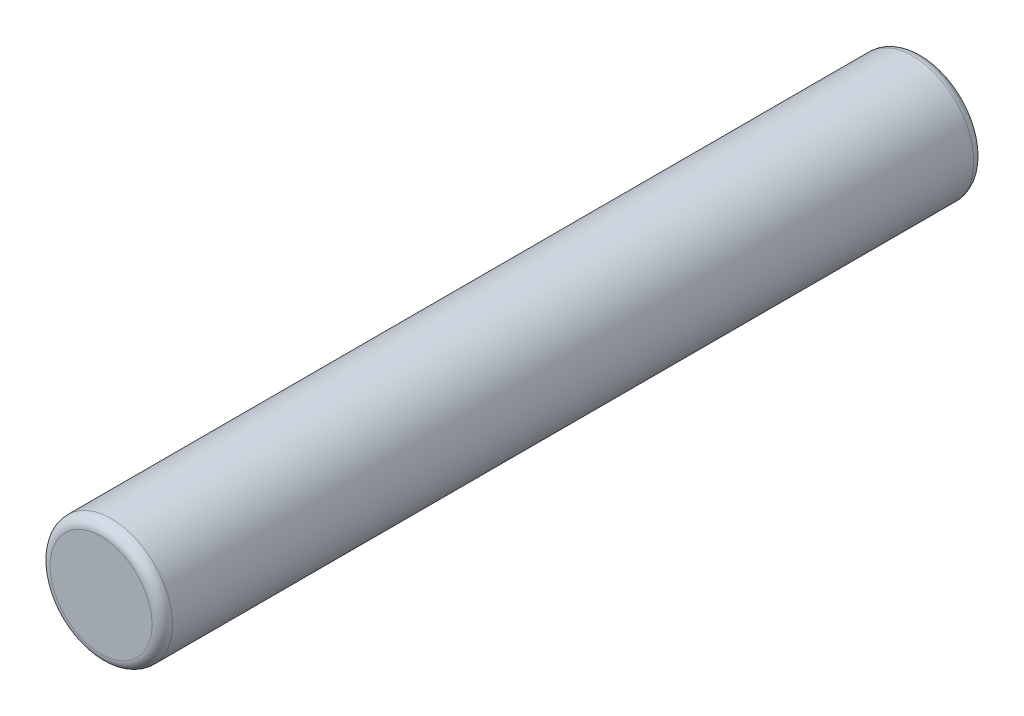
ISO-10303-21;
HEADER;
FILE_DESCRIPTION(('STEP AP214'),'2;1');
FILE_NAME('part.step','',(''),(''),'','','');
FILE_SCHEMA(('AUTOMOTIVE_DESIGN { 1 0 10303 214 1 1 1 1 }'));
ENDSEC;
DATA;
#1=APPLICATION_CONTEXT('core data for automotive mechanical design processes');
#2=APPLICATION_PROTOCOL_DEFINITION('international standard','automotive_design',2000,#1);
#3=PRODUCT_CONTEXT('',#1,'mechanical');
#4=PRODUCT('Part','Part','',(#3));
#5=PRODUCT_RELATED_PRODUCT_CATEGORY('part','',(#4));
#6=PRODUCT_DEFINITION_FORMATION('','',#4);
#7=PRODUCT_DEFINITION_CONTEXT('part definition',#1,'design');
#8=PRODUCT_DEFINITION('design','',#6,#7);
#9=PRODUCT_DEFINITION_SHAPE('','',#8);
#10=(LENGTH_UNIT() NAMED_UNIT(*) SI_UNIT(.MILLI.,.METRE.));
#11=(NAMED_UNIT(*) PLANE_ANGLE_UNIT() SI_UNIT($,.RADIAN.));
#12=(NAMED_UNIT(*) SI_UNIT($,.STERADIAN.) SOLID_ANGLE_UNIT());
#13=UNCERTAINTY_MEASURE_WITH_UNIT(LENGTH_MEASURE(1.E-05),#10,'distance_accuracy_value','');
#14=(GEOMETRIC_REPRESENTATION_CONTEXT(3) GLOBAL_UNCERTAINTY_ASSIGNED_CONTEXT((#13)) GLOBAL_UNIT_ASSIGNED_CONTEXT((#10,
#11,#12)) REPRESENTATION_CONTEXT('',''));
#15=CARTESIAN_POINT('',(0.,0.,0.));
#16=DIRECTION('',(0.,0.,1.));
#17=DIRECTION('',(1.,0.,0.));
#18=AXIS2_PLACEMENT_3D('',#15,#16,#17);
#19=CARTESIAN_POINT('',(0.,0.,40.3));
#20=DIRECTION('',(0.,0.,-1.));
#21=DIRECTION('',(-1.,0.,0.));
#22=AXIS2_PLACEMENT_3D('',#19,#20,#21);
#23=CYLINDRICAL_SURFACE('',#22,3.);
#24=CARTESIAN_POINT('',(0.,0.,39.8));
#25=DIRECTION('',(0.,0.,1.));
#26=DIRECTION('',(1.,0.,0.));
#27=AXIS2_PLACEMENT_3D('',#24,#25,#26);
#28=CIRCLE('',#27,3.);
#29=CARTESIAN_POINT('',(3.,0.,39.8));
#30=VERTEX_POINT('',#29);
#31=EDGE_CURVE('E12',#30,#30,#28,.F.);
#32=ORIENTED_EDGE('',*,*,#31,.T.);
#33=EDGE_LOOP('',(#32));
#34=FACE_BOUND('',#33,.T.);
#35=CARTESIAN_POINT('',(0.,0.,0.5));
#36=DIRECTION('',(0.,0.,1.));
#37=DIRECTION('',(1.,0.,0.));
#38=AXIS2_PLACEMENT_3D('',#35,#36,#37);
#39=CIRCLE('',#38,3.);
#40=CARTESIAN_POINT('',(3.,0.,0.5));
#41=VERTEX_POINT('',#40);
#42=EDGE_CURVE('E57',#41,#41,#39,.T.);
#43=ORIENTED_EDGE('',*,*,#42,.T.);
#44=EDGE_LOOP('',(#43));
#45=FACE_BOUND('',#44,.T.);
#46=ADVANCED_FACE('F42',(#34,#45),#23,.T.);
#47=CARTESIAN_POINT('',(0.,0.,40.3));
#48=DIRECTION('',(0.,0.,1.));
#49=DIRECTION('',(1.,0.,0.));
#50=AXIS2_PLACEMENT_3D('',#47,#48,#49);
#51=PLANE('',#50);
#52=CARTESIAN_POINT('',(0.,0.,40.3));
#53=DIRECTION('',(0.,0.,1.));
#54=DIRECTION('',(1.,0.,0.));
#55=AXIS2_PLACEMENT_3D('',#52,#53,#54);
#56=CIRCLE('',#55,2.5);
#57=CARTESIAN_POINT('',(2.5,0.,40.3));
#58=VERTEX_POINT('',#57);
#59=EDGE_CURVE('E49',#58,#58,#56,.T.);
#60=ORIENTED_EDGE('',*,*,#59,.T.);
#61=EDGE_LOOP('',(#60));
#62=FACE_BOUND('',#61,.T.);
#63=ADVANCED_FACE('F73',(#62),#51,.T.);
#64=CARTESIAN_POINT('',(0.,0.,0.));
#65=DIRECTION('',(0.,0.,1.));
#66=DIRECTION('',(1.,0.,0.));
#67=AXIS2_PLACEMENT_3D('',#64,#65,#66);
#68=PLANE('',#67);
#69=CARTESIAN_POINT('',(0.,0.,0.));
#70=DIRECTION('',(0.,0.,1.));
#71=DIRECTION('',(1.,0.,0.));
#72=AXIS2_PLACEMENT_3D('',#69,#70,#71);
#73=CIRCLE('',#72,2.5);
#74=CARTESIAN_POINT('',(2.5,0.,0.));
#75=VERTEX_POINT('',#74);
#76=EDGE_CURVE('E53',#75,#75,#73,.F.);
#77=ORIENTED_EDGE('',*,*,#76,.T.);
#78=EDGE_LOOP('',(#77));
#79=FACE_BOUND('',#78,.T.);
#80=ADVANCED_FACE('F66',(#79),#68,.F.);
#81=CARTESIAN_POINT('',(0.,0.,0.5));
#82=DIRECTION('',(0.,0.,1.));
#83=DIRECTION('',(1.,0.,0.));
#84=AXIS2_PLACEMENT_3D('',#81,#82,#83);
#85=TOROIDAL_SURFACE('',#84,2.5,0.5);
#86=ORIENTED_EDGE('',*,*,#76,.F.);
#87=EDGE_LOOP('',(#86));
#88=FACE_BOUND('',#87,.T.);
#89=ORIENTED_EDGE('',*,*,#42,.F.);
#90=EDGE_LOOP('',(#89));
#91=FACE_BOUND('',#90,.T.);
#92=ADVANCED_FACE('F64',(#88,#91),#85,.T.);
#93=CARTESIAN_POINT('',(0.,0.,39.8));
#94=DIRECTION('',(0.,0.,1.));
#95=DIRECTION('',(1.,0.,0.));
#96=AXIS2_PLACEMENT_3D('',#93,#94,#95);
#97=TOROIDAL_SURFACE('',#96,2.5,0.5);
#98=ORIENTED_EDGE('',*,*,#31,.F.);
#99=EDGE_LOOP('',(#98));
#100=FACE_BOUND('',#99,.T.);
#101=ORIENTED_EDGE('',*,*,#59,.F.);
#102=EDGE_LOOP('',(#101));
#103=FACE_BOUND('',#102,.T.);
#104=ADVANCED_FACE('F44',(#100,#103),#97,.T.);
#105=CLOSED_SHELL('',(#46,#63,#80,#92,#104));
#106=MANIFOLD_SOLID_BREP('B2',#105);
#107=ADVANCED_BREP_SHAPE_REPRESENTATION('',(#18,#106),#14);
#108=SHAPE_DEFINITION_REPRESENTATION(#9,#107);
ENDSEC;
END-ISO-10303-21;
